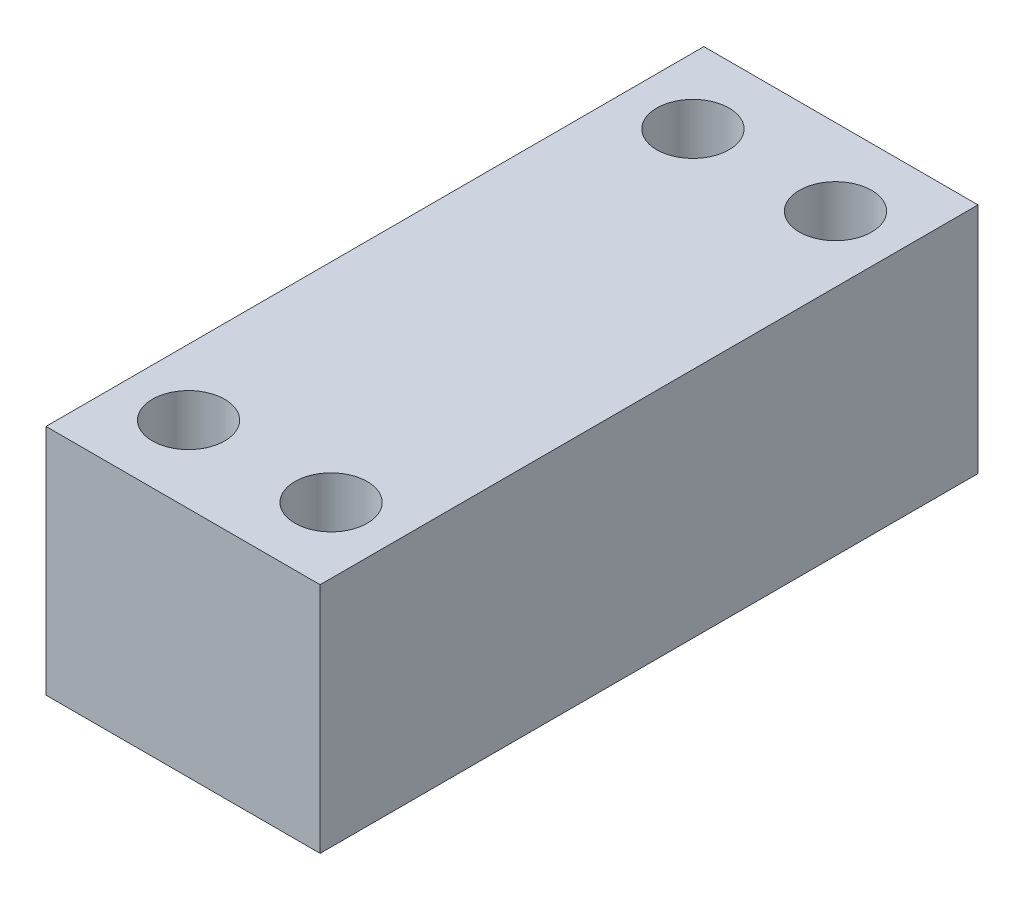
ISO-10303-21;
HEADER;
FILE_DESCRIPTION(('STEP AP214'),'2;1');
FILE_NAME('part.step','',(''),(''),'','','');
FILE_SCHEMA(('AUTOMOTIVE_DESIGN { 1 0 10303 214 1 1 1 1 }'));
ENDSEC;
DATA;
#1=APPLICATION_CONTEXT('core data for automotive mechanical design processes');
#2=APPLICATION_PROTOCOL_DEFINITION('international standard','automotive_design',2000,#1);
#3=PRODUCT_CONTEXT('',#1,'mechanical');
#4=PRODUCT('Part','Part','',(#3));
#5=PRODUCT_RELATED_PRODUCT_CATEGORY('part','',(#4));
#6=PRODUCT_DEFINITION_FORMATION('','',#4);
#7=PRODUCT_DEFINITION_CONTEXT('part definition',#1,'design');
#8=PRODUCT_DEFINITION('design','',#6,#7);
#9=PRODUCT_DEFINITION_SHAPE('','',#8);
#10=(LENGTH_UNIT() NAMED_UNIT(*) SI_UNIT(.MILLI.,.METRE.));
#11=(NAMED_UNIT(*) PLANE_ANGLE_UNIT() SI_UNIT($,.RADIAN.));
#12=(NAMED_UNIT(*) SI_UNIT($,.STERADIAN.) SOLID_ANGLE_UNIT());
#13=UNCERTAINTY_MEASURE_WITH_UNIT(LENGTH_MEASURE(1.E-05),#10,'distance_accuracy_value','');
#14=(GEOMETRIC_REPRESENTATION_CONTEXT(3) GLOBAL_UNCERTAINTY_ASSIGNED_CONTEXT((#13)) GLOBAL_UNIT_ASSIGNED_CONTEXT((#10,
#11,#12)) REPRESENTATION_CONTEXT('',''));
#15=CARTESIAN_POINT('',(0.,0.,0.));
#16=DIRECTION('',(0.,0.,1.));
#17=DIRECTION('',(1.,0.,0.));
#18=AXIS2_PLACEMENT_3D('',#15,#16,#17);
#19=CARTESIAN_POINT('',(0.,21.22424,0.));
#20=DIRECTION('',(0.,1.,0.));
#21=DIRECTION('',(0.,0.,1.));
#22=AXIS2_PLACEMENT_3D('',#19,#20,#21);
#23=PLANE('',#22);
#24=CARTESIAN_POINT('',(18.9999999999999,21.22424,23.));
#25=DIRECTION('',(0.,1.,0.));
#26=DIRECTION('',(0.,0.,1.));
#27=AXIS2_PLACEMENT_3D('',#24,#25,#26);
#28=CIRCLE('',#27,3.30000000000009);
#29=CARTESIAN_POINT('',(18.9999999999999,21.22424,26.3000000000001));
#30=VERTEX_POINT('',#29);
#31=EDGE_CURVE('E122',#30,#30,#28,.T.);
#32=ORIENTED_EDGE('',*,*,#31,.F.);
#33=EDGE_LOOP('',(#32));
#34=FACE_BOUND('',#33,.T.);
#35=CARTESIAN_POINT('',(18.9999999999999,21.22424,-23.));
#36=DIRECTION('',(0.,1.,0.));
#37=DIRECTION('',(0.,0.,1.));
#38=AXIS2_PLACEMENT_3D('',#35,#36,#37);
#39=CIRCLE('',#38,3.30000000000009);
#40=CARTESIAN_POINT('',(18.9999999999999,21.22424,-19.6999999999999));
#41=VERTEX_POINT('',#40);
#42=EDGE_CURVE('E101',#41,#41,#39,.T.);
#43=ORIENTED_EDGE('',*,*,#42,.F.);
#44=EDGE_LOOP('',(#43));
#45=FACE_BOUND('',#44,.T.);
#46=DIRECTION('',(0.,0.,1.));
#47=VECTOR('',#46,1.);
#48=CARTESIAN_POINT('',(0.,21.22424,-30.));
#49=LINE('',#48,#47);
#50=CARTESIAN_POINT('',(0.,21.22424,-30.));
#51=VERTEX_POINT('',#50);
#52=CARTESIAN_POINT('',(0.,21.22424,30.));
#53=VERTEX_POINT('',#52);
#54=EDGE_CURVE('E86',#51,#53,#49,.T.);
#55=ORIENTED_EDGE('',*,*,#54,.T.);
#56=DIRECTION('',(1.,0.,0.));
#57=VECTOR('',#56,1.);
#58=CARTESIAN_POINT('',(0.,21.22424,30.));
#59=LINE('',#58,#57);
#60=CARTESIAN_POINT('',(24.9999999999999,21.22424,30.));
#61=VERTEX_POINT('',#60);
#62=EDGE_CURVE('E81',#53,#61,#59,.T.);
#63=ORIENTED_EDGE('',*,*,#62,.T.);
#64=DIRECTION('',(0.,0.,-1.));
#65=VECTOR('',#64,1.);
#66=CARTESIAN_POINT('',(24.9999999999999,21.22424,-30.));
#67=LINE('',#66,#65);
#68=CARTESIAN_POINT('',(24.9999999999999,21.22424,-30.));
#69=VERTEX_POINT('',#68);
#70=EDGE_CURVE('E84',#61,#69,#67,.T.);
#71=ORIENTED_EDGE('',*,*,#70,.T.);
#72=DIRECTION('',(-1.,0.,0.));
#73=VECTOR('',#72,1.);
#74=CARTESIAN_POINT('',(0.,21.22424,-30.));
#75=LINE('',#74,#73);
#76=EDGE_CURVE('E51',#69,#51,#75,.T.);
#77=ORIENTED_EDGE('',*,*,#76,.T.);
#78=EDGE_LOOP('',(#55,#63,#71,#77));
#79=FACE_BOUND('',#78,.T.);
#80=CARTESIAN_POINT('',(6.00000000000001,21.22424,-23.));
#81=DIRECTION('',(0.,1.,0.));
#82=DIRECTION('',(0.,0.,1.));
#83=AXIS2_PLACEMENT_3D('',#80,#81,#82);
#84=CIRCLE('',#83,3.30000000000009);
#85=CARTESIAN_POINT('',(6.00000000000001,21.22424,-19.6999999999999));
#86=VERTEX_POINT('',#85);
#87=EDGE_CURVE('E116',#86,#86,#84,.T.);
#88=ORIENTED_EDGE('',*,*,#87,.F.);
#89=EDGE_LOOP('',(#88));
#90=FACE_BOUND('',#89,.T.);
#91=CARTESIAN_POINT('',(6.00000000000001,21.22424,23.));
#92=DIRECTION('',(0.,1.,0.));
#93=DIRECTION('',(0.,0.,1.));
#94=AXIS2_PLACEMENT_3D('',#91,#92,#93);
#95=CIRCLE('',#94,3.30000000000009);
#96=CARTESIAN_POINT('',(6.00000000000001,21.22424,26.3000000000001));
#97=VERTEX_POINT('',#96);
#98=EDGE_CURVE('E128',#97,#97,#95,.T.);
#99=ORIENTED_EDGE('',*,*,#98,.F.);
#100=EDGE_LOOP('',(#99));
#101=FACE_BOUND('',#100,.T.);
#102=ADVANCED_FACE('F34',(#34,#45,#79,#90,#101),#23,.T.);
#103=CARTESIAN_POINT('',(0.,0.,0.));
#104=DIRECTION('',(0.,1.,0.));
#105=DIRECTION('',(0.,0.,1.));
#106=AXIS2_PLACEMENT_3D('',#103,#104,#105);
#107=PLANE('',#106);
#108=DIRECTION('',(0.,0.,1.));
#109=VECTOR('',#108,1.);
#110=CARTESIAN_POINT('',(0.,0.,-30.));
#111=LINE('',#110,#109);
#112=CARTESIAN_POINT('',(0.,0.,-30.));
#113=VERTEX_POINT('',#112);
#114=CARTESIAN_POINT('',(0.,0.,30.));
#115=VERTEX_POINT('',#114);
#116=EDGE_CURVE('E98',#113,#115,#111,.T.);
#117=ORIENTED_EDGE('',*,*,#116,.F.);
#118=DIRECTION('',(-1.,0.,0.));
#119=VECTOR('',#118,1.);
#120=CARTESIAN_POINT('',(0.,0.,-30.));
#121=LINE('',#120,#119);
#122=CARTESIAN_POINT('',(24.9999999999999,0.,-30.));
#123=VERTEX_POINT('',#122);
#124=EDGE_CURVE('E74',#123,#113,#121,.T.);
#125=ORIENTED_EDGE('',*,*,#124,.F.);
#126=DIRECTION('',(0.,0.,-1.));
#127=VECTOR('',#126,1.);
#128=CARTESIAN_POINT('',(24.9999999999999,0.,-30.));
#129=LINE('',#128,#127);
#130=CARTESIAN_POINT('',(24.9999999999999,0.,30.));
#131=VERTEX_POINT('',#130);
#132=EDGE_CURVE('E68',#131,#123,#129,.T.);
#133=ORIENTED_EDGE('',*,*,#132,.F.);
#134=DIRECTION('',(1.,0.,0.));
#135=VECTOR('',#134,1.);
#136=CARTESIAN_POINT('',(0.,0.,30.));
#137=LINE('',#136,#135);
#138=EDGE_CURVE('E90',#115,#131,#137,.T.);
#139=ORIENTED_EDGE('',*,*,#138,.F.);
#140=EDGE_LOOP('',(#117,#125,#133,#139));
#141=FACE_BOUND('',#140,.T.);
#142=CARTESIAN_POINT('',(18.9999999999999,0.,-23.));
#143=DIRECTION('',(0.,1.,0.));
#144=DIRECTION('',(0.,0.,1.));
#145=AXIS2_PLACEMENT_3D('',#142,#143,#144);
#146=CIRCLE('',#145,3.30000000000009);
#147=CARTESIAN_POINT('',(18.9999999999999,0.,-19.6999999999999));
#148=VERTEX_POINT('',#147);
#149=EDGE_CURVE('E113',#148,#148,#146,.T.);
#150=ORIENTED_EDGE('',*,*,#149,.T.);
#151=EDGE_LOOP('',(#150));
#152=FACE_BOUND('',#151,.T.);
#153=CARTESIAN_POINT('',(6.00000000000001,0.,-23.));
#154=DIRECTION('',(0.,1.,0.));
#155=DIRECTION('',(0.,0.,1.));
#156=AXIS2_PLACEMENT_3D('',#153,#154,#155);
#157=CIRCLE('',#156,3.30000000000009);
#158=CARTESIAN_POINT('',(6.00000000000001,0.,-19.6999999999999));
#159=VERTEX_POINT('',#158);
#160=EDGE_CURVE('E119',#159,#159,#157,.T.);
#161=ORIENTED_EDGE('',*,*,#160,.T.);
#162=EDGE_LOOP('',(#161));
#163=FACE_BOUND('',#162,.T.);
#164=CARTESIAN_POINT('',(18.9999999999999,0.,23.));
#165=DIRECTION('',(0.,1.,0.));
#166=DIRECTION('',(0.,0.,1.));
#167=AXIS2_PLACEMENT_3D('',#164,#165,#166);
#168=CIRCLE('',#167,3.30000000000009);
#169=CARTESIAN_POINT('',(18.9999999999999,0.,26.3000000000001));
#170=VERTEX_POINT('',#169);
#171=EDGE_CURVE('E125',#170,#170,#168,.T.);
#172=ORIENTED_EDGE('',*,*,#171,.T.);
#173=EDGE_LOOP('',(#172));
#174=FACE_BOUND('',#173,.T.);
#175=CARTESIAN_POINT('',(6.00000000000001,0.,23.));
#176=DIRECTION('',(0.,1.,0.));
#177=DIRECTION('',(0.,0.,1.));
#178=AXIS2_PLACEMENT_3D('',#175,#176,#177);
#179=CIRCLE('',#178,3.30000000000009);
#180=CARTESIAN_POINT('',(6.00000000000001,0.,26.3000000000001));
#181=VERTEX_POINT('',#180);
#182=EDGE_CURVE('E131',#181,#181,#179,.T.);
#183=ORIENTED_EDGE('',*,*,#182,.T.);
#184=EDGE_LOOP('',(#183));
#185=FACE_BOUND('',#184,.T.);
#186=ADVANCED_FACE('F109',(#141,#152,#163,#174,#185),#107,.F.);
#187=CARTESIAN_POINT('',(0.,21.22424,-30.));
#188=DIRECTION('',(1.,0.,0.));
#189=DIRECTION('',(0.,0.,-1.));
#190=AXIS2_PLACEMENT_3D('',#187,#188,#189);
#191=PLANE('',#190);
#192=ORIENTED_EDGE('',*,*,#116,.T.);
#193=DIRECTION('',(0.,-1.,0.));
#194=VECTOR('',#193,1.);
#195=CARTESIAN_POINT('',(0.,21.22424,30.));
#196=LINE('',#195,#194);
#197=EDGE_CURVE('E11',#53,#115,#196,.T.);
#198=ORIENTED_EDGE('',*,*,#197,.F.);
#199=ORIENTED_EDGE('',*,*,#54,.F.);
#200=DIRECTION('',(0.,-1.,0.));
#201=VECTOR('',#200,1.);
#202=CARTESIAN_POINT('',(0.,21.22424,-30.));
#203=LINE('',#202,#201);
#204=EDGE_CURVE('E94',#51,#113,#203,.T.);
#205=ORIENTED_EDGE('',*,*,#204,.T.);
#206=EDGE_LOOP('',(#192,#198,#199,#205));
#207=FACE_BOUND('',#206,.T.);
#208=ADVANCED_FACE('F36',(#207),#191,.F.);
#209=CARTESIAN_POINT('',(0.,21.22424,30.));
#210=DIRECTION('',(0.,0.,-1.));
#211=DIRECTION('',(-1.,0.,0.));
#212=AXIS2_PLACEMENT_3D('',#209,#210,#211);
#213=PLANE('',#212);
#214=ORIENTED_EDGE('',*,*,#138,.T.);
#215=DIRECTION('',(0.,-1.,0.));
#216=VECTOR('',#215,1.);
#217=CARTESIAN_POINT('',(24.9999999999999,21.22424,30.));
#218=LINE('',#217,#216);
#219=EDGE_CURVE('E43',#61,#131,#218,.T.);
#220=ORIENTED_EDGE('',*,*,#219,.F.);
#221=ORIENTED_EDGE('',*,*,#62,.F.);
#222=ORIENTED_EDGE('',*,*,#197,.T.);
#223=EDGE_LOOP('',(#214,#220,#221,#222));
#224=FACE_BOUND('',#223,.T.);
#225=ADVANCED_FACE('F89',(#224),#213,.F.);
#226=CARTESIAN_POINT('',(24.9999999999999,21.22424,-30.));
#227=DIRECTION('',(-1.,0.,0.));
#228=DIRECTION('',(0.,0.,1.));
#229=AXIS2_PLACEMENT_3D('',#226,#227,#228);
#230=PLANE('',#229);
#231=ORIENTED_EDGE('',*,*,#132,.T.);
#232=DIRECTION('',(0.,-1.,0.));
#233=VECTOR('',#232,1.);
#234=CARTESIAN_POINT('',(24.9999999999999,21.22424,-30.));
#235=LINE('',#234,#233);
#236=EDGE_CURVE('E91',#69,#123,#235,.T.);
#237=ORIENTED_EDGE('',*,*,#236,.F.);
#238=ORIENTED_EDGE('',*,*,#70,.F.);
#239=ORIENTED_EDGE('',*,*,#219,.T.);
#240=EDGE_LOOP('',(#231,#237,#238,#239));
#241=FACE_BOUND('',#240,.T.);
#242=ADVANCED_FACE('F92',(#241),#230,.F.);
#243=CARTESIAN_POINT('',(0.,21.22424,-30.));
#244=DIRECTION('',(0.,0.,1.));
#245=DIRECTION('',(1.,0.,0.));
#246=AXIS2_PLACEMENT_3D('',#243,#244,#245);
#247=PLANE('',#246);
#248=ORIENTED_EDGE('',*,*,#124,.T.);
#249=ORIENTED_EDGE('',*,*,#204,.F.);
#250=ORIENTED_EDGE('',*,*,#76,.F.);
#251=ORIENTED_EDGE('',*,*,#236,.T.);
#252=EDGE_LOOP('',(#248,#249,#250,#251));
#253=FACE_BOUND('',#252,.T.);
#254=ADVANCED_FACE('F106',(#253),#247,.F.);
#255=CARTESIAN_POINT('',(18.9999999999999,21.22424,-23.));
#256=DIRECTION('',(0.,-1.,0.));
#257=DIRECTION('',(0.,0.,-1.));
#258=AXIS2_PLACEMENT_3D('',#255,#256,#257);
#259=CYLINDRICAL_SURFACE('',#258,3.30000000000009);
#260=ORIENTED_EDGE('',*,*,#42,.T.);
#261=EDGE_LOOP('',(#260));
#262=FACE_BOUND('',#261,.T.);
#263=ORIENTED_EDGE('',*,*,#149,.F.);
#264=EDGE_LOOP('',(#263));
#265=FACE_BOUND('',#264,.T.);
#266=ADVANCED_FACE('F150',(#262,#265),#259,.F.);
#267=CARTESIAN_POINT('',(6.00000000000001,21.22424,-23.));
#268=DIRECTION('',(0.,-1.,0.));
#269=DIRECTION('',(0.,0.,-1.));
#270=AXIS2_PLACEMENT_3D('',#267,#268,#269);
#271=CYLINDRICAL_SURFACE('',#270,3.30000000000009);
#272=ORIENTED_EDGE('',*,*,#87,.T.);
#273=EDGE_LOOP('',(#272));
#274=FACE_BOUND('',#273,.T.);
#275=ORIENTED_EDGE('',*,*,#160,.F.);
#276=EDGE_LOOP('',(#275));
#277=FACE_BOUND('',#276,.T.);
#278=ADVANCED_FACE('F196',(#274,#277),#271,.F.);
#279=CARTESIAN_POINT('',(18.9999999999999,21.22424,23.));
#280=DIRECTION('',(0.,-1.,0.));
#281=DIRECTION('',(0.,0.,-1.));
#282=AXIS2_PLACEMENT_3D('',#279,#280,#281);
#283=CYLINDRICAL_SURFACE('',#282,3.30000000000009);
#284=ORIENTED_EDGE('',*,*,#31,.T.);
#285=EDGE_LOOP('',(#284));
#286=FACE_BOUND('',#285,.T.);
#287=ORIENTED_EDGE('',*,*,#171,.F.);
#288=EDGE_LOOP('',(#287));
#289=FACE_BOUND('',#288,.T.);
#290=ADVANCED_FACE('F204',(#286,#289),#283,.F.);
#291=CARTESIAN_POINT('',(6.00000000000001,21.22424,23.));
#292=DIRECTION('',(0.,-1.,0.));
#293=DIRECTION('',(0.,0.,-1.));
#294=AXIS2_PLACEMENT_3D('',#291,#292,#293);
#295=CYLINDRICAL_SURFACE('',#294,3.30000000000009);
#296=ORIENTED_EDGE('',*,*,#98,.T.);
#297=EDGE_LOOP('',(#296));
#298=FACE_BOUND('',#297,.T.);
#299=ORIENTED_EDGE('',*,*,#182,.F.);
#300=EDGE_LOOP('',(#299));
#301=FACE_BOUND('',#300,.T.);
#302=ADVANCED_FACE('F137',(#298,#301),#295,.F.);
#303=CLOSED_SHELL('',(#102,#186,#208,#225,#242,#254,#266,#278,#290,#302));
#304=MANIFOLD_SOLID_BREP('B2',#303);
#305=ADVANCED_BREP_SHAPE_REPRESENTATION('',(#18,#304),#14);
#306=SHAPE_DEFINITION_REPRESENTATION(#9,#305);
ENDSEC;
END-ISO-10303-21;
